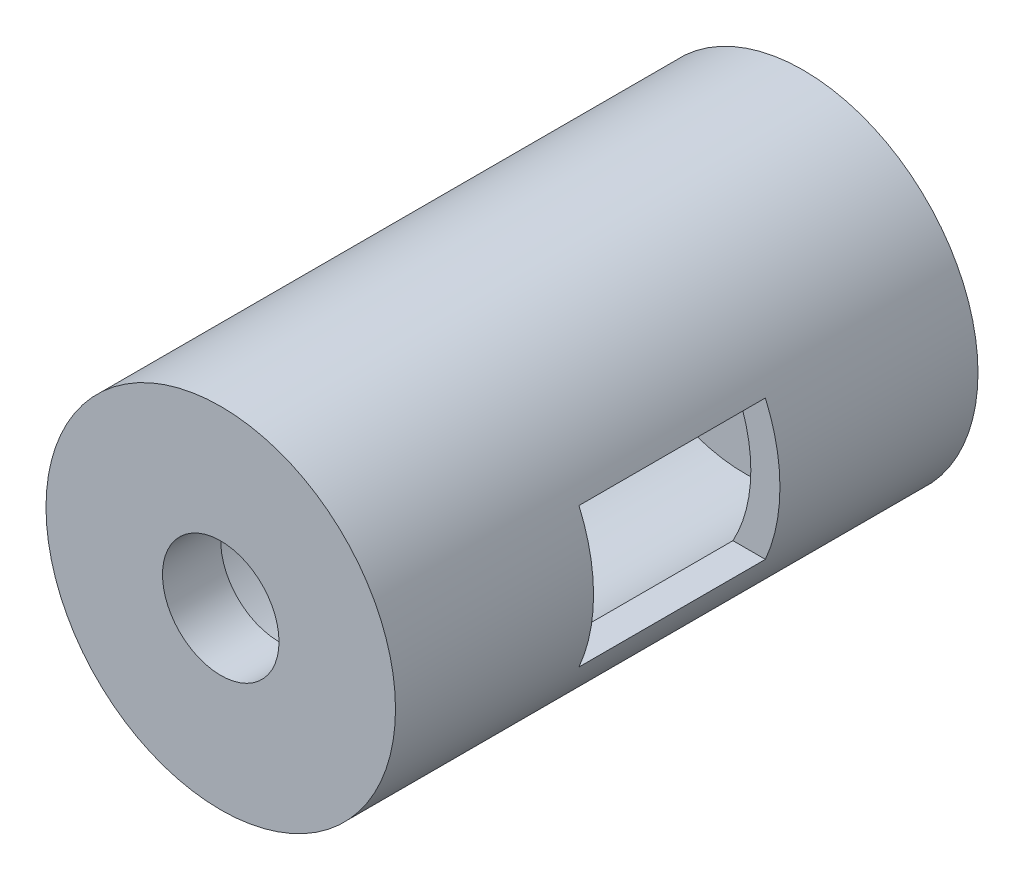
ISO-10303-21;
HEADER;
FILE_DESCRIPTION(('STEP AP214'),'2;1');
FILE_NAME('part.step','',(''),(''),'','','');
FILE_SCHEMA(('AUTOMOTIVE_DESIGN { 1 0 10303 214 1 1 1 1 }'));
ENDSEC;
DATA;
#1=APPLICATION_CONTEXT('core data for automotive mechanical design processes');
#2=APPLICATION_PROTOCOL_DEFINITION('international standard','automotive_design',2000,#1);
#3=PRODUCT_CONTEXT('',#1,'mechanical');
#4=PRODUCT('Part','Part','',(#3));
#5=PRODUCT_RELATED_PRODUCT_CATEGORY('part','',(#4));
#6=PRODUCT_DEFINITION_FORMATION('','',#4);
#7=PRODUCT_DEFINITION_CONTEXT('part definition',#1,'design');
#8=PRODUCT_DEFINITION('design','',#6,#7);
#9=PRODUCT_DEFINITION_SHAPE('','',#8);
#10=(LENGTH_UNIT() NAMED_UNIT(*) SI_UNIT(.MILLI.,.METRE.));
#11=(NAMED_UNIT(*) PLANE_ANGLE_UNIT() SI_UNIT($,.RADIAN.));
#12=(NAMED_UNIT(*) SI_UNIT($,.STERADIAN.) SOLID_ANGLE_UNIT());
#13=UNCERTAINTY_MEASURE_WITH_UNIT(LENGTH_MEASURE(1.E-05),#10,'distance_accuracy_value','');
#14=(GEOMETRIC_REPRESENTATION_CONTEXT(3) GLOBAL_UNCERTAINTY_ASSIGNED_CONTEXT((#13)) GLOBAL_UNIT_ASSIGNED_CONTEXT((#10,
#11,#12)) REPRESENTATION_CONTEXT('',''));
#15=CARTESIAN_POINT('',(0.,0.,0.));
#16=DIRECTION('',(0.,0.,1.));
#17=DIRECTION('',(1.,0.,0.));
#18=AXIS2_PLACEMENT_3D('',#15,#16,#17);
#19=CARTESIAN_POINT('',(3.86402393847526,-0.112000693868845,40.));
#20=DIRECTION('',(0.,0.,-1.));
#21=DIRECTION('',(-1.,0.,0.));
#22=AXIS2_PLACEMENT_3D('',#19,#20,#21);
#23=CYLINDRICAL_SURFACE('',#22,12.5);
#24=CARTESIAN_POINT('',(3.86402393847526,-0.112000693868845,40.));
#25=DIRECTION('',(0.,0.,1.));
#26=DIRECTION('',(1.,0.,0.));
#27=AXIS2_PLACEMENT_3D('',#24,#25,#26);
#28=CIRCLE('',#27,12.5);
#29=CARTESIAN_POINT('',(16.3640239384753,-0.112000693868845,40.));
#30=VERTEX_POINT('',#29);
#31=EDGE_CURVE('E120',#30,#30,#28,.T.);
#32=ORIENTED_EDGE('',*,*,#31,.T.);
#33=EDGE_LOOP('',(#32));
#34=FACE_BOUND('',#33,.T.);
#35=CARTESIAN_POINT('',(3.86402393847526,-0.112000693868845,0.));
#36=DIRECTION('',(0.,0.,1.));
#37=DIRECTION('',(1.,0.,0.));
#38=AXIS2_PLACEMENT_3D('',#35,#36,#37);
#39=CIRCLE('',#38,12.5);
#40=CARTESIAN_POINT('',(16.3640239384753,-0.112000693868845,0.));
#41=VERTEX_POINT('',#40);
#42=EDGE_CURVE('E92',#41,#41,#39,.T.);
#43=ORIENTED_EDGE('',*,*,#42,.F.);
#44=EDGE_LOOP('',(#43));
#45=FACE_BOUND('',#44,.T.);
#46=DIRECTION('',(0.,0.,-1.));
#47=VECTOR('',#46,1.);
#48=CARTESIAN_POINT('',(14.8298800382059,-6.11200069386885,40.));
#49=LINE('',#48,#47);
#50=CARTESIAN_POINT('',(14.8298800382059,-6.11200069386885,28.));
#51=VERTEX_POINT('',#50);
#52=CARTESIAN_POINT('',(14.8298800382059,-6.11200069386885,12.));
#53=VERTEX_POINT('',#52);
#54=EDGE_CURVE('E152',#51,#53,#49,.T.);
#55=ORIENTED_EDGE('',*,*,#54,.T.);
#56=CARTESIAN_POINT('',(3.86402393847526,-0.112000693868845,12.));
#57=DIRECTION('',(0.,0.,1.));
#58=DIRECTION('',(0.,-1.,0.));
#59=AXIS2_PLACEMENT_3D('',#56,#57,#58);
#60=CIRCLE('',#59,12.5);
#61=CARTESIAN_POINT('',(14.8298800382059,5.88799930613115,12.));
#62=VERTEX_POINT('',#61);
#63=EDGE_CURVE('E99',#53,#62,#60,.T.);
#64=ORIENTED_EDGE('',*,*,#63,.T.);
#65=DIRECTION('',(0.,0.,-1.));
#66=VECTOR('',#65,1.);
#67=CARTESIAN_POINT('',(14.8298800382059,5.88799930613115,40.));
#68=LINE('',#67,#66);
#69=CARTESIAN_POINT('',(14.8298800382059,5.88799930613115,28.));
#70=VERTEX_POINT('',#69);
#71=EDGE_CURVE('E144',#62,#70,#68,.F.);
#72=ORIENTED_EDGE('',*,*,#71,.T.);
#73=CARTESIAN_POINT('',(3.86402393847526,-0.112000693868845,28.));
#74=DIRECTION('',(0.,0.,-1.));
#75=DIRECTION('',(-1.,0.,0.));
#76=AXIS2_PLACEMENT_3D('',#73,#74,#75);
#77=CIRCLE('',#76,12.5);
#78=EDGE_CURVE('E148',#70,#51,#77,.T.);
#79=ORIENTED_EDGE('',*,*,#78,.T.);
#80=EDGE_LOOP('',(#55,#64,#72,#79));
#81=FACE_BOUND('',#80,.T.);
#82=ADVANCED_FACE('F47',(#34,#45,#81),#23,.F.);
#83=CARTESIAN_POINT('',(3.86402393847526,-0.112000693868845,40.));
#84=DIRECTION('',(0.,0.,-1.));
#85=DIRECTION('',(-1.,0.,0.));
#86=AXIS2_PLACEMENT_3D('',#83,#84,#85);
#87=CYLINDRICAL_SURFACE('',#86,15.);
#88=CARTESIAN_POINT('',(3.86402393847526,-0.112000693868845,-4.99999999999999));
#89=DIRECTION('',(0.,0.,-1.));
#90=DIRECTION('',(-1.,0.,0.));
#91=AXIS2_PLACEMENT_3D('',#88,#89,#90);
#92=CIRCLE('',#91,15.);
#93=CARTESIAN_POINT('',(-11.1359760615247,-0.112000693868845,-4.99999999999999));
#94=VERTEX_POINT('',#93);
#95=EDGE_CURVE('E128',#94,#94,#92,.T.);
#96=ORIENTED_EDGE('',*,*,#95,.F.);
#97=EDGE_LOOP('',(#96));
#98=FACE_BOUND('',#97,.T.);
#99=CARTESIAN_POINT('',(3.86402393847526,-0.112000693868845,45.));
#100=DIRECTION('',(0.,0.,1.));
#101=DIRECTION('',(1.,0.,0.));
#102=AXIS2_PLACEMENT_3D('',#99,#100,#101);
#103=CIRCLE('',#102,15.);
#104=CARTESIAN_POINT('',(18.8640239384753,-0.112000693868845,45.));
#105=VERTEX_POINT('',#104);
#106=EDGE_CURVE('E124',#105,#105,#103,.T.);
#107=ORIENTED_EDGE('',*,*,#106,.F.);
#108=EDGE_LOOP('',(#107));
#109=FACE_BOUND('',#108,.T.);
#110=CARTESIAN_POINT('',(3.86402393847526,-0.112000693868845,12.));
#111=DIRECTION('',(0.,0.,1.));
#112=DIRECTION('',(0.,-1.,0.));
#113=AXIS2_PLACEMENT_3D('',#110,#111,#112);
#114=CIRCLE('',#113,15.);
#115=CARTESIAN_POINT('',(17.6117510233428,-6.11200069386885,12.));
#116=VERTEX_POINT('',#115);
#117=CARTESIAN_POINT('',(17.6117510233428,5.88799930613115,12.));
#118=VERTEX_POINT('',#117);
#119=EDGE_CURVE('E11',#116,#118,#114,.T.);
#120=ORIENTED_EDGE('',*,*,#119,.F.);
#121=DIRECTION('',(0.,0.,-1.));
#122=VECTOR('',#121,1.);
#123=CARTESIAN_POINT('',(17.6117510233428,-6.11200069386885,40.));
#124=LINE('',#123,#122);
#125=CARTESIAN_POINT('',(17.6117510233428,-6.11200069386885,28.));
#126=VERTEX_POINT('',#125);
#127=EDGE_CURVE('E85',#126,#116,#124,.T.);
#128=ORIENTED_EDGE('',*,*,#127,.F.);
#129=CARTESIAN_POINT('',(3.86402393847526,-0.112000693868845,28.));
#130=DIRECTION('',(0.,0.,-1.));
#131=DIRECTION('',(-1.,0.,0.));
#132=AXIS2_PLACEMENT_3D('',#129,#130,#131);
#133=CIRCLE('',#132,15.);
#134=CARTESIAN_POINT('',(17.6117510233428,5.88799930613115,28.));
#135=VERTEX_POINT('',#134);
#136=EDGE_CURVE('E91',#135,#126,#133,.T.);
#137=ORIENTED_EDGE('',*,*,#136,.F.);
#138=DIRECTION('',(0.,0.,-1.));
#139=VECTOR('',#138,1.);
#140=CARTESIAN_POINT('',(17.6117510233428,5.88799930613115,40.));
#141=LINE('',#140,#139);
#142=EDGE_CURVE('E56',#118,#135,#141,.F.);
#143=ORIENTED_EDGE('',*,*,#142,.F.);
#144=EDGE_LOOP('',(#120,#128,#137,#143));
#145=FACE_BOUND('',#144,.T.);
#146=ADVANCED_FACE('F49',(#98,#109,#145),#87,.T.);
#147=CARTESIAN_POINT('',(3.86402393847526,-0.112000693868845,0.));
#148=DIRECTION('',(0.,0.,-1.));
#149=DIRECTION('',(-1.,0.,0.));
#150=AXIS2_PLACEMENT_3D('',#147,#148,#149);
#151=PLANE('',#150);
#152=CARTESIAN_POINT('',(3.86402393847526,-0.112000693868845,0.));
#153=DIRECTION('',(0.,0.,-1.));
#154=DIRECTION('',(-1.,0.,0.));
#155=AXIS2_PLACEMENT_3D('',#152,#153,#154);
#156=CIRCLE('',#155,5.);
#157=CARTESIAN_POINT('',(-1.13597606152474,-0.112000693868845,0.));
#158=VERTEX_POINT('',#157);
#159=EDGE_CURVE('E115',#158,#158,#156,.T.);
#160=ORIENTED_EDGE('',*,*,#159,.T.);
#161=EDGE_LOOP('',(#160));
#162=FACE_BOUND('',#161,.T.);
#163=ORIENTED_EDGE('',*,*,#42,.T.);
#164=EDGE_LOOP('',(#163));
#165=FACE_BOUND('',#164,.T.);
#166=ADVANCED_FACE('F180',(#162,#165),#151,.F.);
#167=CARTESIAN_POINT('',(3.86402393847526,-0.112000693868845,40.));
#168=DIRECTION('',(0.,0.,1.));
#169=DIRECTION('',(1.,0.,0.));
#170=AXIS2_PLACEMENT_3D('',#167,#168,#169);
#171=PLANE('',#170);
#172=CARTESIAN_POINT('',(3.86402393847526,-0.112000693868845,40.));
#173=DIRECTION('',(0.,0.,1.));
#174=DIRECTION('',(1.,0.,0.));
#175=AXIS2_PLACEMENT_3D('',#172,#173,#174);
#176=CIRCLE('',#175,5.);
#177=CARTESIAN_POINT('',(8.86402393847526,-0.112000693868845,40.));
#178=VERTEX_POINT('',#177);
#179=EDGE_CURVE('E111',#178,#178,#176,.T.);
#180=ORIENTED_EDGE('',*,*,#179,.T.);
#181=EDGE_LOOP('',(#180));
#182=FACE_BOUND('',#181,.T.);
#183=ORIENTED_EDGE('',*,*,#31,.F.);
#184=EDGE_LOOP('',(#183));
#185=FACE_BOUND('',#184,.T.);
#186=ADVANCED_FACE('F184',(#182,#185),#171,.F.);
#187=CARTESIAN_POINT('',(3.86402393847526,-0.112000693868845,155.));
#188=DIRECTION('',(0.,0.,-1.));
#189=DIRECTION('',(-1.,0.,0.));
#190=AXIS2_PLACEMENT_3D('',#187,#188,#189);
#191=CYLINDRICAL_SURFACE('',#190,5.);
#192=CARTESIAN_POINT('',(3.86402393847526,-0.112000693868845,45.));
#193=DIRECTION('',(0.,0.,1.));
#194=DIRECTION('',(1.,0.,0.));
#195=AXIS2_PLACEMENT_3D('',#192,#193,#194);
#196=CIRCLE('',#195,5.);
#197=CARTESIAN_POINT('',(8.86402393847526,-0.112000693868845,45.));
#198=VERTEX_POINT('',#197);
#199=EDGE_CURVE('E132',#198,#198,#196,.T.);
#200=ORIENTED_EDGE('',*,*,#199,.T.);
#201=EDGE_LOOP('',(#200));
#202=FACE_BOUND('',#201,.T.);
#203=ORIENTED_EDGE('',*,*,#179,.F.);
#204=EDGE_LOOP('',(#203));
#205=FACE_BOUND('',#204,.T.);
#206=ADVANCED_FACE('F187',(#202,#205),#191,.F.);
#207=CARTESIAN_POINT('',(3.86402393847526,-0.112000693868845,-4.99999999999999));
#208=DIRECTION('',(0.,0.,-1.));
#209=DIRECTION('',(-1.,0.,0.));
#210=AXIS2_PLACEMENT_3D('',#207,#208,#209);
#211=CIRCLE('',#210,5.);
#212=CARTESIAN_POINT('',(-1.13597606152474,-0.112000693868845,-4.99999999999999));
#213=VERTEX_POINT('',#212);
#214=EDGE_CURVE('E116',#213,#213,#211,.T.);
#215=ORIENTED_EDGE('',*,*,#214,.T.);
#216=EDGE_LOOP('',(#215));
#217=FACE_BOUND('',#216,.T.);
#218=ORIENTED_EDGE('',*,*,#159,.F.);
#219=EDGE_LOOP('',(#218));
#220=FACE_BOUND('',#219,.T.);
#221=ADVANCED_FACE('F192',(#217,#220),#191,.F.);
#222=CARTESIAN_POINT('',(3.86402393847526,-0.112000693868845,45.));
#223=DIRECTION('',(0.,0.,1.));
#224=DIRECTION('',(1.,0.,0.));
#225=AXIS2_PLACEMENT_3D('',#222,#223,#224);
#226=PLANE('',#225);
#227=ORIENTED_EDGE('',*,*,#199,.F.);
#228=EDGE_LOOP('',(#227));
#229=FACE_BOUND('',#228,.T.);
#230=ORIENTED_EDGE('',*,*,#106,.T.);
#231=EDGE_LOOP('',(#230));
#232=FACE_BOUND('',#231,.T.);
#233=ADVANCED_FACE('F189',(#229,#232),#226,.T.);
#234=CARTESIAN_POINT('',(3.86402393847526,-0.112000693868845,-4.99999999999999));
#235=DIRECTION('',(0.,0.,-1.));
#236=DIRECTION('',(-1.,0.,0.));
#237=AXIS2_PLACEMENT_3D('',#234,#235,#236);
#238=PLANE('',#237);
#239=ORIENTED_EDGE('',*,*,#214,.F.);
#240=EDGE_LOOP('',(#239));
#241=FACE_BOUND('',#240,.T.);
#242=ORIENTED_EDGE('',*,*,#95,.T.);
#243=EDGE_LOOP('',(#242));
#244=FACE_BOUND('',#243,.T.);
#245=ADVANCED_FACE('F173',(#241,#244),#238,.T.);
#246=CARTESIAN_POINT('',(160.,5.88799930613115,12.));
#247=DIRECTION('',(0.,0.,1.));
#248=DIRECTION('',(0.,-1.,0.));
#249=AXIS2_PLACEMENT_3D('',#246,#247,#248);
#250=PLANE('',#249);
#251=DIRECTION('',(-1.,0.,0.));
#252=VECTOR('',#251,1.);
#253=CARTESIAN_POINT('',(160.,-6.11200069386885,12.));
#254=LINE('',#253,#252);
#255=EDGE_CURVE('E63',#116,#53,#254,.T.);
#256=ORIENTED_EDGE('',*,*,#255,.F.);
#257=ORIENTED_EDGE('',*,*,#119,.T.);
#258=DIRECTION('',(-1.,0.,0.));
#259=VECTOR('',#258,1.);
#260=CARTESIAN_POINT('',(160.,5.88799930613115,12.));
#261=LINE('',#260,#259);
#262=EDGE_CURVE('E155',#118,#62,#261,.T.);
#263=ORIENTED_EDGE('',*,*,#262,.T.);
#264=ORIENTED_EDGE('',*,*,#63,.F.);
#265=EDGE_LOOP('',(#256,#257,#263,#264));
#266=FACE_BOUND('',#265,.T.);
#267=ADVANCED_FACE('F95',(#266),#250,.T.);
#268=CARTESIAN_POINT('',(160.,5.88799930613115,12.));
#269=DIRECTION('',(0.,-1.,0.));
#270=DIRECTION('',(0.,0.,-1.));
#271=AXIS2_PLACEMENT_3D('',#268,#269,#270);
#272=PLANE('',#271);
#273=ORIENTED_EDGE('',*,*,#262,.F.);
#274=ORIENTED_EDGE('',*,*,#142,.T.);
#275=DIRECTION('',(-1.,0.,0.));
#276=VECTOR('',#275,1.);
#277=CARTESIAN_POINT('',(160.,5.88799930613115,28.));
#278=LINE('',#277,#276);
#279=EDGE_CURVE('E158',#135,#70,#278,.T.);
#280=ORIENTED_EDGE('',*,*,#279,.T.);
#281=ORIENTED_EDGE('',*,*,#71,.F.);
#282=EDGE_LOOP('',(#273,#274,#280,#281));
#283=FACE_BOUND('',#282,.T.);
#284=ADVANCED_FACE('F165',(#283),#272,.T.);
#285=CARTESIAN_POINT('',(160.,5.88799930613115,28.));
#286=DIRECTION('',(0.,0.,-1.));
#287=DIRECTION('',(-1.,0.,0.));
#288=AXIS2_PLACEMENT_3D('',#285,#286,#287);
#289=PLANE('',#288);
#290=ORIENTED_EDGE('',*,*,#279,.F.);
#291=ORIENTED_EDGE('',*,*,#136,.T.);
#292=DIRECTION('',(-1.,0.,0.));
#293=VECTOR('',#292,1.);
#294=CARTESIAN_POINT('',(160.,-6.11200069386885,28.));
#295=LINE('',#294,#293);
#296=EDGE_CURVE('E68',#126,#51,#295,.T.);
#297=ORIENTED_EDGE('',*,*,#296,.T.);
#298=ORIENTED_EDGE('',*,*,#78,.F.);
#299=EDGE_LOOP('',(#290,#291,#297,#298));
#300=FACE_BOUND('',#299,.T.);
#301=ADVANCED_FACE('F163',(#300),#289,.T.);
#302=CARTESIAN_POINT('',(160.,-6.11200069386885,12.));
#303=DIRECTION('',(0.,1.,0.));
#304=DIRECTION('',(0.,0.,1.));
#305=AXIS2_PLACEMENT_3D('',#302,#303,#304);
#306=PLANE('',#305);
#307=ORIENTED_EDGE('',*,*,#296,.F.);
#308=ORIENTED_EDGE('',*,*,#127,.T.);
#309=ORIENTED_EDGE('',*,*,#255,.T.);
#310=ORIENTED_EDGE('',*,*,#54,.F.);
#311=EDGE_LOOP('',(#307,#308,#309,#310));
#312=FACE_BOUND('',#311,.T.);
#313=ADVANCED_FACE('F86',(#312),#306,.T.);
#314=CLOSED_SHELL('',(#82,#146,#166,#186,#206,#221,#233,#245,#267,#284,#301,#313));
#315=MANIFOLD_SOLID_BREP('B2',#314);
#316=ADVANCED_BREP_SHAPE_REPRESENTATION('',(#18,#315),#14);
#317=SHAPE_DEFINITION_REPRESENTATION(#9,#316);
ENDSEC;
END-ISO-10303-21;
